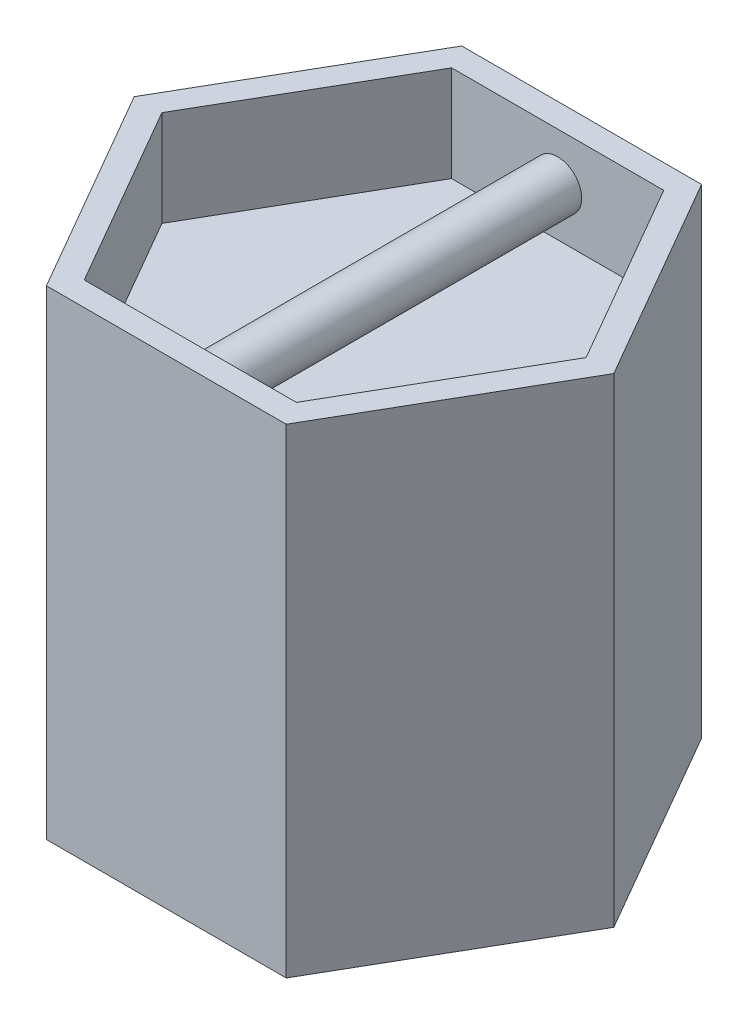
ISO-10303-21;
HEADER;
FILE_DESCRIPTION(('STEP AP214'),'2;1');
FILE_NAME('part.step','',(''),(''),'','','');
FILE_SCHEMA(('AUTOMOTIVE_DESIGN { 1 0 10303 214 1 1 1 1 }'));
ENDSEC;
DATA;
#1=APPLICATION_CONTEXT('core data for automotive mechanical design processes');
#2=APPLICATION_PROTOCOL_DEFINITION('international standard','automotive_design',2000,#1);
#3=PRODUCT_CONTEXT('',#1,'mechanical');
#4=PRODUCT('Part','Part','',(#3));
#5=PRODUCT_RELATED_PRODUCT_CATEGORY('part','',(#4));
#6=PRODUCT_DEFINITION_FORMATION('','',#4);
#7=PRODUCT_DEFINITION_CONTEXT('part definition',#1,'design');
#8=PRODUCT_DEFINITION('design','',#6,#7);
#9=PRODUCT_DEFINITION_SHAPE('','',#8);
#10=(LENGTH_UNIT() NAMED_UNIT(*) SI_UNIT(.MILLI.,.METRE.));
#11=(NAMED_UNIT(*) PLANE_ANGLE_UNIT() SI_UNIT($,.RADIAN.));
#12=(NAMED_UNIT(*) SI_UNIT($,.STERADIAN.) SOLID_ANGLE_UNIT());
#13=UNCERTAINTY_MEASURE_WITH_UNIT(LENGTH_MEASURE(1.E-05),#10,'distance_accuracy_value','');
#14=(GEOMETRIC_REPRESENTATION_CONTEXT(3) GLOBAL_UNCERTAINTY_ASSIGNED_CONTEXT((#13)) GLOBAL_UNIT_ASSIGNED_CONTEXT((#10,
#11,#12)) REPRESENTATION_CONTEXT('',''));
#15=CARTESIAN_POINT('',(0.,0.,0.));
#16=DIRECTION('',(0.,0.,1.));
#17=DIRECTION('',(1.,0.,0.));
#18=AXIS2_PLACEMENT_3D('',#15,#16,#17);
#19=CARTESIAN_POINT('',(5.00000000000015,20.,8.66025403784441));
#20=DIRECTION('',(-0.866025403784441,0.,-0.499999999999995));
#21=DIRECTION('',(-0.499999999999995,0.,0.866025403784441));
#22=AXIS2_PLACEMENT_3D('',#19,#20,#21);
#23=PLANE('',#22);
#24=DIRECTION('',(0.499999999999995,0.,-0.866025403784441));
#25=VECTOR('',#24,1.);
#26=CARTESIAN_POINT('',(5.00000000000015,0.,8.66025403784441));
#27=LINE('',#26,#25);
#28=CARTESIAN_POINT('',(5.00000000000015,0.,8.66025403784441));
#29=VERTEX_POINT('',#28);
#30=CARTESIAN_POINT('',(10.0000000000001,0.,0.));
#31=VERTEX_POINT('',#30);
#32=EDGE_CURVE('E144',#29,#31,#27,.T.);
#33=ORIENTED_EDGE('',*,*,#32,.T.);
#34=DIRECTION('',(0.,-1.,0.));
#35=VECTOR('',#34,1.);
#36=CARTESIAN_POINT('',(10.0000000000001,20.,0.));
#37=LINE('',#36,#35);
#38=CARTESIAN_POINT('',(10.0000000000001,20.,0.));
#39=VERTEX_POINT('',#38);
#40=EDGE_CURVE('E11',#39,#31,#37,.T.);
#41=ORIENTED_EDGE('',*,*,#40,.F.);
#42=DIRECTION('',(0.499999999999995,0.,-0.866025403784441));
#43=VECTOR('',#42,1.);
#44=CARTESIAN_POINT('',(5.00000000000015,20.,8.66025403784441));
#45=LINE('',#44,#43);
#46=CARTESIAN_POINT('',(5.00000000000015,20.,8.66025403784441));
#47=VERTEX_POINT('',#46);
#48=EDGE_CURVE('E162',#47,#39,#45,.T.);
#49=ORIENTED_EDGE('',*,*,#48,.F.);
#50=DIRECTION('',(0.,-1.,0.));
#51=VECTOR('',#50,1.);
#52=CARTESIAN_POINT('',(5.00000000000015,20.,8.66025403784441));
#53=LINE('',#52,#51);
#54=EDGE_CURVE('E140',#47,#29,#53,.T.);
#55=ORIENTED_EDGE('',*,*,#54,.T.);
#56=EDGE_LOOP('',(#33,#41,#49,#55));
#57=FACE_BOUND('',#56,.T.);
#58=ADVANCED_FACE('F43',(#57),#23,.F.);
#59=CARTESIAN_POINT('',(10.0000000000001,20.,0.));
#60=DIRECTION('',(-0.866025403784438,0.,0.500000000000001));
#61=DIRECTION('',(0.500000000000001,0.,0.866025403784438));
#62=AXIS2_PLACEMENT_3D('',#59,#60,#61);
#63=PLANE('',#62);
#64=DIRECTION('',(-0.500000000000001,0.,-0.866025403784438));
#65=VECTOR('',#64,1.);
#66=CARTESIAN_POINT('',(10.0000000000001,0.,0.));
#67=LINE('',#66,#65);
#68=CARTESIAN_POINT('',(5.00000000000003,0.,-8.66025403784448));
#69=VERTEX_POINT('',#68);
#70=EDGE_CURVE('E148',#31,#69,#67,.T.);
#71=ORIENTED_EDGE('',*,*,#70,.T.);
#72=DIRECTION('',(0.,-1.,0.));
#73=VECTOR('',#72,1.);
#74=CARTESIAN_POINT('',(5.00000000000003,20.,-8.66025403784448));
#75=LINE('',#74,#73);
#76=CARTESIAN_POINT('',(5.00000000000003,20.,-8.66025403784448));
#77=VERTEX_POINT('',#76);
#78=EDGE_CURVE('E51',#77,#69,#75,.T.);
#79=ORIENTED_EDGE('',*,*,#78,.F.);
#80=DIRECTION('',(-0.500000000000001,0.,-0.866025403784438));
#81=VECTOR('',#80,1.);
#82=CARTESIAN_POINT('',(10.0000000000001,20.,0.));
#83=LINE('',#82,#81);
#84=EDGE_CURVE('E102',#39,#77,#83,.T.);
#85=ORIENTED_EDGE('',*,*,#84,.F.);
#86=ORIENTED_EDGE('',*,*,#40,.T.);
#87=EDGE_LOOP('',(#71,#79,#85,#86));
#88=FACE_BOUND('',#87,.T.);
#89=ADVANCED_FACE('F276',(#88),#63,.F.);
#90=CARTESIAN_POINT('',(5.00000000000003,20.,-8.66025403784448));
#91=DIRECTION('',(0.,0.,1.));
#92=DIRECTION('',(1.,0.,0.));
#93=AXIS2_PLACEMENT_3D('',#90,#91,#92);
#94=PLANE('',#93);
#95=DIRECTION('',(-1.,0.,0.));
#96=VECTOR('',#95,1.);
#97=CARTESIAN_POINT('',(5.00000000000003,0.,-8.66025403784448));
#98=LINE('',#97,#96);
#99=CARTESIAN_POINT('',(-5.00000000000009,0.,-8.66025403784445));
#100=VERTEX_POINT('',#99);
#101=EDGE_CURVE('E152',#69,#100,#98,.T.);
#102=ORIENTED_EDGE('',*,*,#101,.T.);
#103=DIRECTION('',(0.,-1.,0.));
#104=VECTOR('',#103,1.);
#105=CARTESIAN_POINT('',(-5.00000000000009,20.,-8.66025403784445));
#106=LINE('',#105,#104);
#107=CARTESIAN_POINT('',(-5.00000000000009,20.,-8.66025403784445));
#108=VERTEX_POINT('',#107);
#109=EDGE_CURVE('E133',#108,#100,#106,.T.);
#110=ORIENTED_EDGE('',*,*,#109,.F.);
#111=DIRECTION('',(-1.,0.,0.));
#112=VECTOR('',#111,1.);
#113=CARTESIAN_POINT('',(5.00000000000003,20.,-8.66025403784448));
#114=LINE('',#113,#112);
#115=EDGE_CURVE('E119',#77,#108,#114,.T.);
#116=ORIENTED_EDGE('',*,*,#115,.F.);
#117=ORIENTED_EDGE('',*,*,#78,.T.);
#118=EDGE_LOOP('',(#102,#110,#116,#117));
#119=FACE_BOUND('',#118,.T.);
#120=ADVANCED_FACE('F172',(#119),#94,.F.);
#121=CARTESIAN_POINT('',(-5.00000000000009,20.,-8.66025403784445));
#122=DIRECTION('',(0.866025403784442,0.,0.499999999999995));
#123=DIRECTION('',(0.499999999999995,0.,-0.866025403784442));
#124=AXIS2_PLACEMENT_3D('',#121,#122,#123);
#125=PLANE('',#124);
#126=DIRECTION('',(-0.499999999999995,0.,0.866025403784441));
#127=VECTOR('',#126,1.);
#128=CARTESIAN_POINT('',(-5.00000000000009,0.,-8.66025403784445));
#129=LINE('',#128,#127);
#130=CARTESIAN_POINT('',(-10.0000000000001,0.,0.));
#131=VERTEX_POINT('',#130);
#132=EDGE_CURVE('E129',#100,#131,#129,.T.);
#133=ORIENTED_EDGE('',*,*,#132,.T.);
#134=DIRECTION('',(0.,-1.,0.));
#135=VECTOR('',#134,1.);
#136=CARTESIAN_POINT('',(-10.0000000000001,20.,0.));
#137=LINE('',#136,#135);
#138=CARTESIAN_POINT('',(-10.0000000000001,20.,0.));
#139=VERTEX_POINT('',#138);
#140=EDGE_CURVE('E126',#139,#131,#137,.T.);
#141=ORIENTED_EDGE('',*,*,#140,.F.);
#142=DIRECTION('',(-0.499999999999995,0.,0.866025403784441));
#143=VECTOR('',#142,1.);
#144=CARTESIAN_POINT('',(-5.00000000000009,20.,-8.66025403784445));
#145=LINE('',#144,#143);
#146=EDGE_CURVE('E112',#108,#139,#145,.T.);
#147=ORIENTED_EDGE('',*,*,#146,.F.);
#148=ORIENTED_EDGE('',*,*,#109,.T.);
#149=EDGE_LOOP('',(#133,#141,#147,#148));
#150=FACE_BOUND('',#149,.T.);
#151=ADVANCED_FACE('F127',(#150),#125,.F.);
#152=CARTESIAN_POINT('',(-10.0000000000001,20.,0.));
#153=DIRECTION('',(0.866025403784435,0.,-0.500000000000007));
#154=DIRECTION('',(-0.500000000000007,0.,-0.866025403784435));
#155=AXIS2_PLACEMENT_3D('',#152,#153,#154);
#156=PLANE('',#155);
#157=DIRECTION('',(0.500000000000007,0.,0.866025403784434));
#158=VECTOR('',#157,1.);
#159=CARTESIAN_POINT('',(-10.0000000000001,0.,0.));
#160=LINE('',#159,#158);
#161=CARTESIAN_POINT('',(-4.99999999999997,0.,8.66025403784452));
#162=VERTEX_POINT('',#161);
#163=EDGE_CURVE('E157',#131,#162,#160,.T.);
#164=ORIENTED_EDGE('',*,*,#163,.T.);
#165=DIRECTION('',(0.,-1.,0.));
#166=VECTOR('',#165,1.);
#167=CARTESIAN_POINT('',(-4.99999999999997,20.,8.66025403784452));
#168=LINE('',#167,#166);
#169=CARTESIAN_POINT('',(-4.99999999999997,20.,8.66025403784452));
#170=VERTEX_POINT('',#169);
#171=EDGE_CURVE('E134',#170,#162,#168,.T.);
#172=ORIENTED_EDGE('',*,*,#171,.F.);
#173=DIRECTION('',(0.500000000000007,0.,0.866025403784434));
#174=VECTOR('',#173,1.);
#175=CARTESIAN_POINT('',(-10.0000000000001,20.,0.));
#176=LINE('',#175,#174);
#177=EDGE_CURVE('E116',#139,#170,#176,.T.);
#178=ORIENTED_EDGE('',*,*,#177,.F.);
#179=ORIENTED_EDGE('',*,*,#140,.T.);
#180=EDGE_LOOP('',(#164,#172,#178,#179));
#181=FACE_BOUND('',#180,.T.);
#182=ADVANCED_FACE('F136',(#181),#156,.F.);
#183=CARTESIAN_POINT('',(-4.99999999999997,20.,8.66025403784452));
#184=DIRECTION('',(0.,0.,-1.));
#185=DIRECTION('',(-1.,0.,0.));
#186=AXIS2_PLACEMENT_3D('',#183,#184,#185);
#187=PLANE('',#186);
#188=DIRECTION('',(1.,0.,0.));
#189=VECTOR('',#188,1.);
#190=CARTESIAN_POINT('',(-4.99999999999997,0.,8.66025403784452));
#191=LINE('',#190,#189);
#192=EDGE_CURVE('E94',#162,#29,#191,.T.);
#193=ORIENTED_EDGE('',*,*,#192,.T.);
#194=ORIENTED_EDGE('',*,*,#54,.F.);
#195=DIRECTION('',(1.,0.,0.));
#196=VECTOR('',#195,1.);
#197=CARTESIAN_POINT('',(-4.99999999999997,20.,8.66025403784452));
#198=LINE('',#197,#196);
#199=EDGE_CURVE('E67',#170,#47,#198,.T.);
#200=ORIENTED_EDGE('',*,*,#199,.F.);
#201=ORIENTED_EDGE('',*,*,#171,.T.);
#202=EDGE_LOOP('',(#193,#194,#200,#201));
#203=FACE_BOUND('',#202,.T.);
#204=ADVANCED_FACE('F176',(#203),#187,.F.);
#205=CARTESIAN_POINT('',(0.,20.,0.));
#206=DIRECTION('',(0.,1.,0.));
#207=DIRECTION('',(0.,0.,1.));
#208=AXIS2_PLACEMENT_3D('',#205,#206,#207);
#209=PLANE('',#208);
#210=DIRECTION('',(1.,0.,0.));
#211=VECTOR('',#210,1.);
#212=CARTESIAN_POINT('',(-4.42264973081035,20.,7.66025403784451));
#213=LINE('',#212,#211);
#214=CARTESIAN_POINT('',(-4.42264973081035,20.,7.66025403784451));
#215=VERTEX_POINT('',#214);
#216=CARTESIAN_POINT('',(4.42264973081052,20.,7.66025403784442));
#217=VERTEX_POINT('',#216);
#218=EDGE_CURVE('E58',#215,#217,#213,.T.);
#219=ORIENTED_EDGE('',*,*,#218,.F.);
#220=DIRECTION('',(0.500000000000007,0.,0.866025403784435));
#221=VECTOR('',#220,1.);
#222=CARTESIAN_POINT('',(-8.84529946162085,20.,0.));
#223=LINE('',#222,#221);
#224=CARTESIAN_POINT('',(-8.84529946162085,20.,0.));
#225=VERTEX_POINT('',#224);
#226=EDGE_CURVE('E208',#225,#215,#223,.T.);
#227=ORIENTED_EDGE('',*,*,#226,.F.);
#228=DIRECTION('',(-0.499999999999995,0.,0.866025403784441));
#229=VECTOR('',#228,1.);
#230=CARTESIAN_POINT('',(-4.42264973081046,20.,-7.66025403784445));
#231=LINE('',#230,#229);
#232=CARTESIAN_POINT('',(-4.42264973081046,20.,-7.66025403784445));
#233=VERTEX_POINT('',#232);
#234=EDGE_CURVE('E213',#233,#225,#231,.T.);
#235=ORIENTED_EDGE('',*,*,#234,.F.);
#236=DIRECTION('',(-1.,0.,0.));
#237=VECTOR('',#236,1.);
#238=CARTESIAN_POINT('',(4.42264973081041,20.,-7.66025403784448));
#239=LINE('',#238,#237);
#240=CARTESIAN_POINT('',(4.42264973081041,20.,-7.66025403784448));
#241=VERTEX_POINT('',#240);
#242=EDGE_CURVE('E217',#241,#233,#239,.T.);
#243=ORIENTED_EDGE('',*,*,#242,.F.);
#244=DIRECTION('',(-0.500000000000001,0.,-0.866025403784438));
#245=VECTOR('',#244,1.);
#246=CARTESIAN_POINT('',(8.84529946162085,20.,0.));
#247=LINE('',#246,#245);
#248=CARTESIAN_POINT('',(8.84529946162085,20.,0.));
#249=VERTEX_POINT('',#248);
#250=EDGE_CURVE('E221',#249,#241,#247,.T.);
#251=ORIENTED_EDGE('',*,*,#250,.F.);
#252=DIRECTION('',(0.499999999999995,0.,-0.866025403784441));
#253=VECTOR('',#252,1.);
#254=CARTESIAN_POINT('',(4.42264973081052,20.,7.66025403784442));
#255=LINE('',#254,#253);
#256=EDGE_CURVE('E225',#217,#249,#255,.T.);
#257=ORIENTED_EDGE('',*,*,#256,.F.);
#258=EDGE_LOOP('',(#219,#227,#235,#243,#251,#257));
#259=FACE_BOUND('',#258,.T.);
#260=ORIENTED_EDGE('',*,*,#48,.T.);
#261=ORIENTED_EDGE('',*,*,#84,.T.);
#262=ORIENTED_EDGE('',*,*,#115,.T.);
#263=ORIENTED_EDGE('',*,*,#146,.T.);
#264=ORIENTED_EDGE('',*,*,#177,.T.);
#265=ORIENTED_EDGE('',*,*,#199,.T.);
#266=EDGE_LOOP('',(#260,#261,#262,#263,#264,#265));
#267=FACE_BOUND('',#266,.T.);
#268=ADVANCED_FACE('F114',(#259,#267),#209,.T.);
#269=CARTESIAN_POINT('',(0.,0.,0.));
#270=DIRECTION('',(0.,1.,0.));
#271=DIRECTION('',(0.,0.,1.));
#272=AXIS2_PLACEMENT_3D('',#269,#270,#271);
#273=PLANE('',#272);
#274=ORIENTED_EDGE('',*,*,#32,.F.);
#275=ORIENTED_EDGE('',*,*,#192,.F.);
#276=ORIENTED_EDGE('',*,*,#163,.F.);
#277=ORIENTED_EDGE('',*,*,#132,.F.);
#278=ORIENTED_EDGE('',*,*,#101,.F.);
#279=ORIENTED_EDGE('',*,*,#70,.F.);
#280=EDGE_LOOP('',(#274,#275,#276,#277,#278,#279));
#281=FACE_BOUND('',#280,.T.);
#282=ADVANCED_FACE('F175',(#281),#273,.F.);
#283=CARTESIAN_POINT('',(-4.42264973081035,16.,7.66025403784451));
#284=DIRECTION('',(0.,0.,1.));
#285=DIRECTION('',(1.,0.,0.));
#286=AXIS2_PLACEMENT_3D('',#283,#284,#285);
#287=PLANE('',#286);
#288=CARTESIAN_POINT('',(0.,18.,7.66025403784447));
#289=DIRECTION('',(0.,0.,1.));
#290=DIRECTION('',(1.,0.,0.));
#291=AXIS2_PLACEMENT_3D('',#288,#289,#290);
#292=CIRCLE('',#291,1.);
#293=CARTESIAN_POINT('',(1.,18.,7.66025403784446));
#294=VERTEX_POINT('',#293);
#295=EDGE_CURVE('E257',#294,#294,#292,.T.);
#296=ORIENTED_EDGE('',*,*,#295,.T.);
#297=EDGE_LOOP('',(#296));
#298=FACE_BOUND('',#297,.T.);
#299=ORIENTED_EDGE('',*,*,#218,.T.);
#300=DIRECTION('',(0.,1.,0.));
#301=VECTOR('',#300,1.);
#302=CARTESIAN_POINT('',(4.42264973081052,16.,7.66025403784442));
#303=LINE('',#302,#301);
#304=CARTESIAN_POINT('',(4.42264973081052,16.,7.66025403784442));
#305=VERTEX_POINT('',#304);
#306=EDGE_CURVE('E185',#305,#217,#303,.T.);
#307=ORIENTED_EDGE('',*,*,#306,.F.);
#308=DIRECTION('',(1.,0.,0.));
#309=VECTOR('',#308,1.);
#310=CARTESIAN_POINT('',(-4.42264973081035,16.,7.66025403784451));
#311=LINE('',#310,#309);
#312=CARTESIAN_POINT('',(-4.42264973081035,16.,7.66025403784451));
#313=VERTEX_POINT('',#312);
#314=EDGE_CURVE('E212',#313,#305,#311,.T.);
#315=ORIENTED_EDGE('',*,*,#314,.F.);
#316=DIRECTION('',(0.,1.,0.));
#317=VECTOR('',#316,1.);
#318=CARTESIAN_POINT('',(-4.42264973081035,16.,7.66025403784451));
#319=LINE('',#318,#317);
#320=EDGE_CURVE('E149',#313,#215,#319,.T.);
#321=ORIENTED_EDGE('',*,*,#320,.T.);
#322=EDGE_LOOP('',(#299,#307,#315,#321));
#323=FACE_BOUND('',#322,.T.);
#324=ADVANCED_FACE('F262',(#298,#323),#287,.F.);
#325=CARTESIAN_POINT('',(-8.84529946162085,16.,0.));
#326=DIRECTION('',(-0.866025403784435,0.,0.500000000000007));
#327=DIRECTION('',(0.500000000000007,0.,0.866025403784434));
#328=AXIS2_PLACEMENT_3D('',#325,#326,#327);
#329=PLANE('',#328);
#330=ORIENTED_EDGE('',*,*,#226,.T.);
#331=ORIENTED_EDGE('',*,*,#320,.F.);
#332=DIRECTION('',(0.500000000000007,0.,0.866025403784435));
#333=VECTOR('',#332,1.);
#334=CARTESIAN_POINT('',(-8.84529946162085,16.,0.));
#335=LINE('',#334,#333);
#336=CARTESIAN_POINT('',(-8.84529946162085,16.,0.));
#337=VERTEX_POINT('',#336);
#338=EDGE_CURVE('E190',#337,#313,#335,.T.);
#339=ORIENTED_EDGE('',*,*,#338,.F.);
#340=DIRECTION('',(0.,1.,0.));
#341=VECTOR('',#340,1.);
#342=CARTESIAN_POINT('',(-8.84529946162085,16.,0.));
#343=LINE('',#342,#341);
#344=EDGE_CURVE('E202',#337,#225,#343,.T.);
#345=ORIENTED_EDGE('',*,*,#344,.T.);
#346=EDGE_LOOP('',(#330,#331,#339,#345));
#347=FACE_BOUND('',#346,.T.);
#348=ADVANCED_FACE('F298',(#347),#329,.F.);
#349=CARTESIAN_POINT('',(-4.42264973081046,16.,-7.66025403784445));
#350=DIRECTION('',(-0.866025403784441,0.,-0.499999999999995));
#351=DIRECTION('',(-0.499999999999995,0.,0.866025403784442));
#352=AXIS2_PLACEMENT_3D('',#349,#350,#351);
#353=PLANE('',#352);
#354=ORIENTED_EDGE('',*,*,#234,.T.);
#355=ORIENTED_EDGE('',*,*,#344,.F.);
#356=DIRECTION('',(-0.499999999999995,0.,0.866025403784441));
#357=VECTOR('',#356,1.);
#358=CARTESIAN_POINT('',(-4.42264973081046,16.,-7.66025403784445));
#359=LINE('',#358,#357);
#360=CARTESIAN_POINT('',(-4.42264973081046,16.,-7.66025403784445));
#361=VERTEX_POINT('',#360);
#362=EDGE_CURVE('E235',#361,#337,#359,.T.);
#363=ORIENTED_EDGE('',*,*,#362,.F.);
#364=DIRECTION('',(0.,1.,0.));
#365=VECTOR('',#364,1.);
#366=CARTESIAN_POINT('',(-4.42264973081046,16.,-7.66025403784445));
#367=LINE('',#366,#365);
#368=EDGE_CURVE('E198',#361,#233,#367,.T.);
#369=ORIENTED_EDGE('',*,*,#368,.T.);
#370=EDGE_LOOP('',(#354,#355,#363,#369));
#371=FACE_BOUND('',#370,.T.);
#372=ADVANCED_FACE('F309',(#371),#353,.F.);
#373=CARTESIAN_POINT('',(4.42264973081041,16.,-7.66025403784448));
#374=DIRECTION('',(0.,0.,-1.));
#375=DIRECTION('',(-1.,0.,0.));
#376=AXIS2_PLACEMENT_3D('',#373,#374,#375);
#377=PLANE('',#376);
#378=CARTESIAN_POINT('',(0.,18.,-7.66025403784447));
#379=DIRECTION('',(0.,0.,-1.));
#380=DIRECTION('',(-1.,0.,0.));
#381=AXIS2_PLACEMENT_3D('',#378,#379,#380);
#382=CIRCLE('',#381,1.);
#383=CARTESIAN_POINT('',(-1.,18.,-7.66025403784446));
#384=VERTEX_POINT('',#383);
#385=EDGE_CURVE('E231',#384,#384,#382,.F.);
#386=ORIENTED_EDGE('',*,*,#385,.F.);
#387=EDGE_LOOP('',(#386));
#388=FACE_BOUND('',#387,.T.);
#389=ORIENTED_EDGE('',*,*,#242,.T.);
#390=ORIENTED_EDGE('',*,*,#368,.F.);
#391=DIRECTION('',(-1.,0.,0.));
#392=VECTOR('',#391,1.);
#393=CARTESIAN_POINT('',(4.42264973081041,16.,-7.66025403784448));
#394=LINE('',#393,#392);
#395=CARTESIAN_POINT('',(4.42264973081041,16.,-7.66025403784448));
#396=VERTEX_POINT('',#395);
#397=EDGE_CURVE('E239',#396,#361,#394,.T.);
#398=ORIENTED_EDGE('',*,*,#397,.F.);
#399=DIRECTION('',(0.,1.,0.));
#400=VECTOR('',#399,1.);
#401=CARTESIAN_POINT('',(4.42264973081041,16.,-7.66025403784448));
#402=LINE('',#401,#400);
#403=EDGE_CURVE('E194',#396,#241,#402,.T.);
#404=ORIENTED_EDGE('',*,*,#403,.T.);
#405=EDGE_LOOP('',(#389,#390,#398,#404));
#406=FACE_BOUND('',#405,.T.);
#407=ADVANCED_FACE('F305',(#388,#406),#377,.F.);
#408=CARTESIAN_POINT('',(8.84529946162085,16.,0.));
#409=DIRECTION('',(0.866025403784438,0.,-0.500000000000001));
#410=DIRECTION('',(-0.500000000000001,0.,-0.866025403784438));
#411=AXIS2_PLACEMENT_3D('',#408,#409,#410);
#412=PLANE('',#411);
#413=ORIENTED_EDGE('',*,*,#250,.T.);
#414=ORIENTED_EDGE('',*,*,#403,.F.);
#415=DIRECTION('',(-0.500000000000001,0.,-0.866025403784438));
#416=VECTOR('',#415,1.);
#417=CARTESIAN_POINT('',(8.84529946162085,16.,0.));
#418=LINE('',#417,#416);
#419=CARTESIAN_POINT('',(8.84529946162085,16.,0.));
#420=VERTEX_POINT('',#419);
#421=EDGE_CURVE('E243',#420,#396,#418,.T.);
#422=ORIENTED_EDGE('',*,*,#421,.F.);
#423=DIRECTION('',(0.,1.,0.));
#424=VECTOR('',#423,1.);
#425=CARTESIAN_POINT('',(8.84529946162085,16.,0.));
#426=LINE('',#425,#424);
#427=EDGE_CURVE('E189',#420,#249,#426,.T.);
#428=ORIENTED_EDGE('',*,*,#427,.T.);
#429=EDGE_LOOP('',(#413,#414,#422,#428));
#430=FACE_BOUND('',#429,.T.);
#431=ADVANCED_FACE('F301',(#430),#412,.F.);
#432=CARTESIAN_POINT('',(4.42264973081052,16.,7.66025403784442));
#433=DIRECTION('',(0.866025403784441,0.,0.499999999999995));
#434=DIRECTION('',(0.499999999999995,0.,-0.866025403784442));
#435=AXIS2_PLACEMENT_3D('',#432,#433,#434);
#436=PLANE('',#435);
#437=ORIENTED_EDGE('',*,*,#256,.T.);
#438=ORIENTED_EDGE('',*,*,#427,.F.);
#439=DIRECTION('',(0.499999999999995,0.,-0.866025403784441));
#440=VECTOR('',#439,1.);
#441=CARTESIAN_POINT('',(4.42264973081052,16.,7.66025403784442));
#442=LINE('',#441,#440);
#443=EDGE_CURVE('E247',#305,#420,#442,.T.);
#444=ORIENTED_EDGE('',*,*,#443,.F.);
#445=ORIENTED_EDGE('',*,*,#306,.T.);
#446=EDGE_LOOP('',(#437,#438,#444,#445));
#447=FACE_BOUND('',#446,.T.);
#448=ADVANCED_FACE('F272',(#447),#436,.F.);
#449=CARTESIAN_POINT('',(0.,16.,0.));
#450=DIRECTION('',(0.,1.,0.));
#451=DIRECTION('',(0.,0.,1.));
#452=AXIS2_PLACEMENT_3D('',#449,#450,#451);
#453=PLANE('',#452);
#454=ORIENTED_EDGE('',*,*,#314,.T.);
#455=ORIENTED_EDGE('',*,*,#443,.T.);
#456=ORIENTED_EDGE('',*,*,#421,.T.);
#457=ORIENTED_EDGE('',*,*,#397,.T.);
#458=ORIENTED_EDGE('',*,*,#362,.T.);
#459=ORIENTED_EDGE('',*,*,#338,.T.);
#460=EDGE_LOOP('',(#454,#455,#456,#457,#458,#459));
#461=FACE_BOUND('',#460,.T.);
#462=ADVANCED_FACE('F266',(#461),#453,.T.);
#463=CARTESIAN_POINT('',(0.,18.,-8.66225403784445));
#464=DIRECTION('',(0.,0.,1.));
#465=DIRECTION('',(1.,0.,0.));
#466=AXIS2_PLACEMENT_3D('',#463,#464,#465);
#467=CYLINDRICAL_SURFACE('',#466,1.);
#468=ORIENTED_EDGE('',*,*,#385,.T.);
#469=EDGE_LOOP('',(#468));
#470=FACE_BOUND('',#469,.T.);
#471=ORIENTED_EDGE('',*,*,#295,.F.);
#472=EDGE_LOOP('',(#471));
#473=FACE_BOUND('',#472,.T.);
#474=ADVANCED_FACE('F264',(#470,#473),#467,.T.);
#475=CLOSED_SHELL('',(#58,#89,#120,#151,#182,#204,#268,#282,#324,#348,#372,#407,#431,#448,#462,#474));
#476=MANIFOLD_SOLID_BREP('B2',#475);
#477=ADVANCED_BREP_SHAPE_REPRESENTATION('',(#18,#476),#14);
#478=SHAPE_DEFINITION_REPRESENTATION(#9,#477);
ENDSEC;
END-ISO-10303-21;
